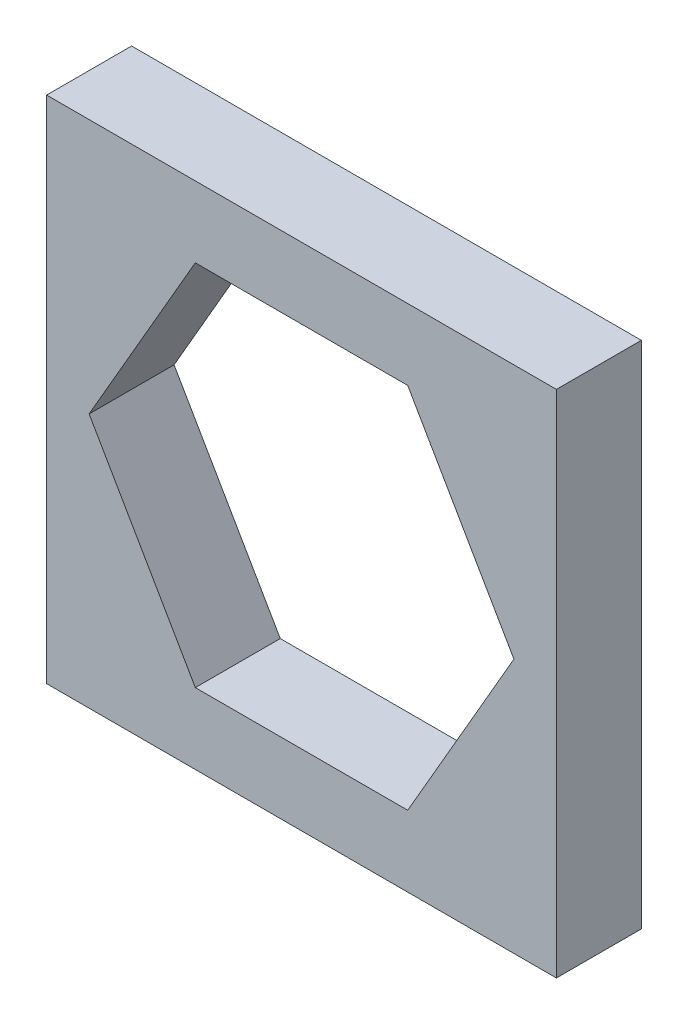
ISO-10303-21;
HEADER;
FILE_DESCRIPTION(('STEP AP214'),'2;1');
FILE_NAME('part.step','',(''),(''),'','','');
FILE_SCHEMA(('AUTOMOTIVE_DESIGN { 1 0 10303 214 1 1 1 1 }'));
ENDSEC;
DATA;
#1=APPLICATION_CONTEXT('core data for automotive mechanical design processes');
#2=APPLICATION_PROTOCOL_DEFINITION('international standard','automotive_design',2000,#1);
#3=PRODUCT_CONTEXT('',#1,'mechanical');
#4=PRODUCT('Part','Part','',(#3));
#5=PRODUCT_RELATED_PRODUCT_CATEGORY('part','',(#4));
#6=PRODUCT_DEFINITION_FORMATION('','',#4);
#7=PRODUCT_DEFINITION_CONTEXT('part definition',#1,'design');
#8=PRODUCT_DEFINITION('design','',#6,#7);
#9=PRODUCT_DEFINITION_SHAPE('','',#8);
#10=(LENGTH_UNIT() NAMED_UNIT(*) SI_UNIT(.MILLI.,.METRE.));
#11=(NAMED_UNIT(*) PLANE_ANGLE_UNIT() SI_UNIT($,.RADIAN.));
#12=(NAMED_UNIT(*) SI_UNIT($,.STERADIAN.) SOLID_ANGLE_UNIT());
#13=UNCERTAINTY_MEASURE_WITH_UNIT(LENGTH_MEASURE(1.E-05),#10,'distance_accuracy_value','');
#14=(GEOMETRIC_REPRESENTATION_CONTEXT(3) GLOBAL_UNCERTAINTY_ASSIGNED_CONTEXT((#13)) GLOBAL_UNIT_ASSIGNED_CONTEXT((#10,
#11,#12)) REPRESENTATION_CONTEXT('',''));
#15=CARTESIAN_POINT('',(0.,0.,0.));
#16=DIRECTION('',(0.,0.,1.));
#17=DIRECTION('',(1.,0.,0.));
#18=AXIS2_PLACEMENT_3D('',#15,#16,#17);
#19=CARTESIAN_POINT('',(0.,0.,10.));
#20=DIRECTION('',(0.,0.,1.));
#21=DIRECTION('',(1.,0.,0.));
#22=AXIS2_PLACEMENT_3D('',#19,#20,#21);
#23=PLANE('',#22);
#24=DIRECTION('',(0.,-1.,0.));
#25=VECTOR('',#24,1.);
#26=CARTESIAN_POINT('',(-30.,30.,10.));
#27=LINE('',#26,#25);
#28=CARTESIAN_POINT('',(-30.,30.,10.));
#29=VERTEX_POINT('',#28);
#30=CARTESIAN_POINT('',(-30.,-30.,10.));
#31=VERTEX_POINT('',#30);
#32=EDGE_CURVE('E191',#29,#31,#27,.T.);
#33=ORIENTED_EDGE('',*,*,#32,.T.);
#34=DIRECTION('',(1.,0.,0.));
#35=VECTOR('',#34,1.);
#36=CARTESIAN_POINT('',(-30.,-30.,10.));
#37=LINE('',#36,#35);
#38=CARTESIAN_POINT('',(30.,-30.,10.));
#39=VERTEX_POINT('',#38);
#40=EDGE_CURVE('E194',#31,#39,#37,.T.);
#41=ORIENTED_EDGE('',*,*,#40,.T.);
#42=DIRECTION('',(0.,-1.,0.));
#43=VECTOR('',#42,1.);
#44=CARTESIAN_POINT('',(30.,30.,10.));
#45=LINE('',#44,#43);
#46=CARTESIAN_POINT('',(30.,30.,10.));
#47=VERTEX_POINT('',#46);
#48=EDGE_CURVE('E197',#47,#39,#45,.T.);
#49=ORIENTED_EDGE('',*,*,#48,.F.);
#50=DIRECTION('',(1.,0.,0.));
#51=VECTOR('',#50,1.);
#52=CARTESIAN_POINT('',(-30.,30.,10.));
#53=LINE('',#52,#51);
#54=EDGE_CURVE('E200',#29,#47,#53,.T.);
#55=ORIENTED_EDGE('',*,*,#54,.F.);
#56=EDGE_LOOP('',(#33,#41,#49,#55));
#57=FACE_BOUND('',#56,.T.);
#58=DIRECTION('',(-0.5,0.866025403784439,0.));
#59=VECTOR('',#58,1.);
#60=CARTESIAN_POINT('',(25.,0.,10.));
#61=LINE('',#60,#59);
#62=CARTESIAN_POINT('',(25.,0.,10.));
#63=VERTEX_POINT('',#62);
#64=CARTESIAN_POINT('',(12.5,21.650635094611,10.));
#65=VERTEX_POINT('',#64);
#66=EDGE_CURVE('E148',#63,#65,#61,.T.);
#67=ORIENTED_EDGE('',*,*,#66,.F.);
#68=DIRECTION('',(0.5,0.866025403784439,0.));
#69=VECTOR('',#68,1.);
#70=CARTESIAN_POINT('',(12.5,-21.650635094611,10.));
#71=LINE('',#70,#69);
#72=CARTESIAN_POINT('',(12.5,-21.650635094611,10.));
#73=VERTEX_POINT('',#72);
#74=EDGE_CURVE('E140',#73,#63,#71,.T.);
#75=ORIENTED_EDGE('',*,*,#74,.F.);
#76=DIRECTION('',(1.,0.,0.));
#77=VECTOR('',#76,1.);
#78=CARTESIAN_POINT('',(-12.5,-21.650635094611,10.));
#79=LINE('',#78,#77);
#80=CARTESIAN_POINT('',(-12.5,-21.650635094611,10.));
#81=VERTEX_POINT('',#80);
#82=EDGE_CURVE('E169',#81,#73,#79,.T.);
#83=ORIENTED_EDGE('',*,*,#82,.F.);
#84=DIRECTION('',(0.5,-0.866025403784439,0.));
#85=VECTOR('',#84,1.);
#86=CARTESIAN_POINT('',(-25.,0.,10.));
#87=LINE('',#86,#85);
#88=CARTESIAN_POINT('',(-25.,0.,10.));
#89=VERTEX_POINT('',#88);
#90=EDGE_CURVE('E167',#89,#81,#87,.T.);
#91=ORIENTED_EDGE('',*,*,#90,.F.);
#92=DIRECTION('',(-0.5,-0.866025403784439,0.));
#93=VECTOR('',#92,1.);
#94=CARTESIAN_POINT('',(-12.5,21.650635094611,10.));
#95=LINE('',#94,#93);
#96=CARTESIAN_POINT('',(-12.5,21.650635094611,10.));
#97=VERTEX_POINT('',#96);
#98=EDGE_CURVE('E163',#97,#89,#95,.T.);
#99=ORIENTED_EDGE('',*,*,#98,.F.);
#100=DIRECTION('',(-1.,0.,0.));
#101=VECTOR('',#100,1.);
#102=CARTESIAN_POINT('',(12.5,21.650635094611,10.));
#103=LINE('',#102,#101);
#104=EDGE_CURVE('E161',#65,#97,#103,.T.);
#105=ORIENTED_EDGE('',*,*,#104,.F.);
#106=EDGE_LOOP('',(#67,#75,#83,#91,#99,#105));
#107=FACE_BOUND('',#106,.T.);
#108=ADVANCED_FACE('F63',(#57,#107),#23,.T.);
#109=CARTESIAN_POINT('',(0.,0.,0.));
#110=DIRECTION('',(0.,0.,1.));
#111=DIRECTION('',(1.,0.,0.));
#112=AXIS2_PLACEMENT_3D('',#109,#110,#111);
#113=PLANE('',#112);
#114=DIRECTION('',(0.,-1.,0.));
#115=VECTOR('',#114,1.);
#116=CARTESIAN_POINT('',(-30.,30.,0.));
#117=LINE('',#116,#115);
#118=CARTESIAN_POINT('',(-30.,30.,0.));
#119=VERTEX_POINT('',#118);
#120=CARTESIAN_POINT('',(-30.,-30.,0.));
#121=VERTEX_POINT('',#120);
#122=EDGE_CURVE('E156',#119,#121,#117,.T.);
#123=ORIENTED_EDGE('',*,*,#122,.F.);
#124=DIRECTION('',(1.,0.,0.));
#125=VECTOR('',#124,1.);
#126=CARTESIAN_POINT('',(-30.,30.,0.));
#127=LINE('',#126,#125);
#128=CARTESIAN_POINT('',(30.,30.,0.));
#129=VERTEX_POINT('',#128);
#130=EDGE_CURVE('E195',#119,#129,#127,.T.);
#131=ORIENTED_EDGE('',*,*,#130,.T.);
#132=DIRECTION('',(0.,-1.,0.));
#133=VECTOR('',#132,1.);
#134=CARTESIAN_POINT('',(30.,30.,0.));
#135=LINE('',#134,#133);
#136=CARTESIAN_POINT('',(30.,-30.,0.));
#137=VERTEX_POINT('',#136);
#138=EDGE_CURVE('E209',#129,#137,#135,.T.);
#139=ORIENTED_EDGE('',*,*,#138,.T.);
#140=DIRECTION('',(1.,0.,0.));
#141=VECTOR('',#140,1.);
#142=CARTESIAN_POINT('',(-30.,-30.,0.));
#143=LINE('',#142,#141);
#144=EDGE_CURVE('E206',#121,#137,#143,.T.);
#145=ORIENTED_EDGE('',*,*,#144,.F.);
#146=EDGE_LOOP('',(#123,#131,#139,#145));
#147=FACE_BOUND('',#146,.T.);
#148=DIRECTION('',(0.5,0.866025403784439,0.));
#149=VECTOR('',#148,1.);
#150=CARTESIAN_POINT('',(12.5,-21.650635094611,0.));
#151=LINE('',#150,#149);
#152=CARTESIAN_POINT('',(12.5,-21.650635094611,0.));
#153=VERTEX_POINT('',#152);
#154=CARTESIAN_POINT('',(25.,0.,0.));
#155=VERTEX_POINT('',#154);
#156=EDGE_CURVE('E86',#153,#155,#151,.T.);
#157=ORIENTED_EDGE('',*,*,#156,.T.);
#158=DIRECTION('',(-0.5,0.866025403784439,0.));
#159=VECTOR('',#158,1.);
#160=CARTESIAN_POINT('',(25.,0.,0.));
#161=LINE('',#160,#159);
#162=CARTESIAN_POINT('',(12.5,21.650635094611,0.));
#163=VERTEX_POINT('',#162);
#164=EDGE_CURVE('E155',#155,#163,#161,.T.);
#165=ORIENTED_EDGE('',*,*,#164,.T.);
#166=DIRECTION('',(-1.,0.,0.));
#167=VECTOR('',#166,1.);
#168=CARTESIAN_POINT('',(12.5,21.650635094611,0.));
#169=LINE('',#168,#167);
#170=CARTESIAN_POINT('',(-12.5,21.650635094611,0.));
#171=VERTEX_POINT('',#170);
#172=EDGE_CURVE('E173',#163,#171,#169,.T.);
#173=ORIENTED_EDGE('',*,*,#172,.T.);
#174=DIRECTION('',(-0.5,-0.866025403784439,0.));
#175=VECTOR('',#174,1.);
#176=CARTESIAN_POINT('',(-12.5,21.650635094611,0.));
#177=LINE('',#176,#175);
#178=CARTESIAN_POINT('',(-25.,0.,0.));
#179=VERTEX_POINT('',#178);
#180=EDGE_CURVE('E176',#171,#179,#177,.T.);
#181=ORIENTED_EDGE('',*,*,#180,.T.);
#182=DIRECTION('',(0.5,-0.866025403784439,0.));
#183=VECTOR('',#182,1.);
#184=CARTESIAN_POINT('',(-25.,0.,0.));
#185=LINE('',#184,#183);
#186=CARTESIAN_POINT('',(-12.5,-21.650635094611,0.));
#187=VERTEX_POINT('',#186);
#188=EDGE_CURVE('E179',#179,#187,#185,.T.);
#189=ORIENTED_EDGE('',*,*,#188,.T.);
#190=DIRECTION('',(1.,0.,0.));
#191=VECTOR('',#190,1.);
#192=CARTESIAN_POINT('',(-12.5,-21.650635094611,0.));
#193=LINE('',#192,#191);
#194=EDGE_CURVE('E149',#187,#153,#193,.T.);
#195=ORIENTED_EDGE('',*,*,#194,.T.);
#196=EDGE_LOOP('',(#157,#165,#173,#181,#189,#195));
#197=FACE_BOUND('',#196,.T.);
#198=ADVANCED_FACE('F226',(#147,#197),#113,.F.);
#199=CARTESIAN_POINT('',(-30.,30.,10.));
#200=DIRECTION('',(1.,0.,0.));
#201=DIRECTION('',(0.,1.,0.));
#202=AXIS2_PLACEMENT_3D('',#199,#200,#201);
#203=PLANE('',#202);
#204=ORIENTED_EDGE('',*,*,#122,.T.);
#205=DIRECTION('',(0.,0.,-1.));
#206=VECTOR('',#205,1.);
#207=CARTESIAN_POINT('',(-30.,-30.,10.));
#208=LINE('',#207,#206);
#209=EDGE_CURVE('E12',#31,#121,#208,.T.);
#210=ORIENTED_EDGE('',*,*,#209,.F.);
#211=ORIENTED_EDGE('',*,*,#32,.F.);
#212=DIRECTION('',(0.,0.,-1.));
#213=VECTOR('',#212,1.);
#214=CARTESIAN_POINT('',(-30.,30.,10.));
#215=LINE('',#214,#213);
#216=EDGE_CURVE('E203',#29,#119,#215,.T.);
#217=ORIENTED_EDGE('',*,*,#216,.T.);
#218=EDGE_LOOP('',(#204,#210,#211,#217));
#219=FACE_BOUND('',#218,.T.);
#220=ADVANCED_FACE('F65',(#219),#203,.F.);
#221=CARTESIAN_POINT('',(-30.,-30.,10.));
#222=DIRECTION('',(0.,1.,0.));
#223=DIRECTION('',(0.,0.,1.));
#224=AXIS2_PLACEMENT_3D('',#221,#222,#223);
#225=PLANE('',#224);
#226=ORIENTED_EDGE('',*,*,#144,.T.);
#227=DIRECTION('',(0.,0.,-1.));
#228=VECTOR('',#227,1.);
#229=CARTESIAN_POINT('',(30.,-30.,10.));
#230=LINE('',#229,#228);
#231=EDGE_CURVE('E71',#39,#137,#230,.T.);
#232=ORIENTED_EDGE('',*,*,#231,.F.);
#233=ORIENTED_EDGE('',*,*,#40,.F.);
#234=ORIENTED_EDGE('',*,*,#209,.T.);
#235=EDGE_LOOP('',(#226,#232,#233,#234));
#236=FACE_BOUND('',#235,.T.);
#237=ADVANCED_FACE('F222',(#236),#225,.F.);
#238=CARTESIAN_POINT('',(30.,30.,10.));
#239=DIRECTION('',(1.,0.,0.));
#240=DIRECTION('',(0.,0.,-1.));
#241=AXIS2_PLACEMENT_3D('',#238,#239,#240);
#242=PLANE('',#241);
#243=ORIENTED_EDGE('',*,*,#138,.F.);
#244=DIRECTION('',(0.,0.,-1.));
#245=VECTOR('',#244,1.);
#246=CARTESIAN_POINT('',(30.,30.,10.));
#247=LINE('',#246,#245);
#248=EDGE_CURVE('E215',#47,#129,#247,.T.);
#249=ORIENTED_EDGE('',*,*,#248,.F.);
#250=ORIENTED_EDGE('',*,*,#48,.T.);
#251=ORIENTED_EDGE('',*,*,#231,.T.);
#252=EDGE_LOOP('',(#243,#249,#250,#251));
#253=FACE_BOUND('',#252,.T.);
#254=ADVANCED_FACE('F219',(#253),#242,.T.);
#255=CARTESIAN_POINT('',(-30.,30.,10.));
#256=DIRECTION('',(0.,1.,0.));
#257=DIRECTION('',(0.,0.,1.));
#258=AXIS2_PLACEMENT_3D('',#255,#256,#257);
#259=PLANE('',#258);
#260=ORIENTED_EDGE('',*,*,#130,.F.);
#261=ORIENTED_EDGE('',*,*,#216,.F.);
#262=ORIENTED_EDGE('',*,*,#54,.T.);
#263=ORIENTED_EDGE('',*,*,#248,.T.);
#264=EDGE_LOOP('',(#260,#261,#262,#263));
#265=FACE_BOUND('',#264,.T.);
#266=ADVANCED_FACE('F230',(#265),#259,.T.);
#267=CARTESIAN_POINT('',(12.5,-21.650635094611,10.));
#268=DIRECTION('',(-0.866025403784439,0.5,0.));
#269=DIRECTION('',(-0.5,-0.866025403784439,0.));
#270=AXIS2_PLACEMENT_3D('',#267,#268,#269);
#271=PLANE('',#270);
#272=ORIENTED_EDGE('',*,*,#156,.F.);
#273=DIRECTION('',(0.,0.,-1.));
#274=VECTOR('',#273,1.);
#275=CARTESIAN_POINT('',(12.5,-21.650635094611,10.));
#276=LINE('',#275,#274);
#277=EDGE_CURVE('E144',#73,#153,#276,.T.);
#278=ORIENTED_EDGE('',*,*,#277,.F.);
#279=ORIENTED_EDGE('',*,*,#74,.T.);
#280=DIRECTION('',(0.,0.,-1.));
#281=VECTOR('',#280,1.);
#282=CARTESIAN_POINT('',(25.,0.,10.));
#283=LINE('',#282,#281);
#284=EDGE_CURVE('E143',#63,#155,#283,.T.);
#285=ORIENTED_EDGE('',*,*,#284,.T.);
#286=EDGE_LOOP('',(#272,#278,#279,#285));
#287=FACE_BOUND('',#286,.T.);
#288=ADVANCED_FACE('F142',(#287),#271,.T.);
#289=CARTESIAN_POINT('',(25.,0.,10.));
#290=DIRECTION('',(-0.866025403784439,-0.5,0.));
#291=DIRECTION('',(0.5,-0.866025403784439,0.));
#292=AXIS2_PLACEMENT_3D('',#289,#290,#291);
#293=PLANE('',#292);
#294=ORIENTED_EDGE('',*,*,#164,.F.);
#295=ORIENTED_EDGE('',*,*,#284,.F.);
#296=ORIENTED_EDGE('',*,*,#66,.T.);
#297=DIRECTION('',(0.,0.,-1.));
#298=VECTOR('',#297,1.);
#299=CARTESIAN_POINT('',(12.5,21.650635094611,10.));
#300=LINE('',#299,#298);
#301=EDGE_CURVE('E157',#65,#163,#300,.T.);
#302=ORIENTED_EDGE('',*,*,#301,.T.);
#303=EDGE_LOOP('',(#294,#295,#296,#302));
#304=FACE_BOUND('',#303,.T.);
#305=ADVANCED_FACE('F152',(#304),#293,.T.);
#306=CARTESIAN_POINT('',(12.5,21.650635094611,10.));
#307=DIRECTION('',(0.,-1.,0.));
#308=DIRECTION('',(1.,0.,0.));
#309=AXIS2_PLACEMENT_3D('',#306,#307,#308);
#310=PLANE('',#309);
#311=ORIENTED_EDGE('',*,*,#172,.F.);
#312=ORIENTED_EDGE('',*,*,#301,.F.);
#313=ORIENTED_EDGE('',*,*,#104,.T.);
#314=DIRECTION('',(0.,0.,-1.));
#315=VECTOR('',#314,1.);
#316=CARTESIAN_POINT('',(-12.5,21.650635094611,10.));
#317=LINE('',#316,#315);
#318=EDGE_CURVE('E188',#97,#171,#317,.T.);
#319=ORIENTED_EDGE('',*,*,#318,.T.);
#320=EDGE_LOOP('',(#311,#312,#313,#319));
#321=FACE_BOUND('',#320,.T.);
#322=ADVANCED_FACE('F270',(#321),#310,.T.);
#323=CARTESIAN_POINT('',(-12.5,21.650635094611,10.));
#324=DIRECTION('',(0.866025403784439,-0.5,0.));
#325=DIRECTION('',(0.5,0.866025403784439,0.));
#326=AXIS2_PLACEMENT_3D('',#323,#324,#325);
#327=PLANE('',#326);
#328=ORIENTED_EDGE('',*,*,#180,.F.);
#329=ORIENTED_EDGE('',*,*,#318,.F.);
#330=ORIENTED_EDGE('',*,*,#98,.T.);
#331=DIRECTION('',(0.,0.,-1.));
#332=VECTOR('',#331,1.);
#333=CARTESIAN_POINT('',(-25.,0.,10.));
#334=LINE('',#333,#332);
#335=EDGE_CURVE('E186',#89,#179,#334,.T.);
#336=ORIENTED_EDGE('',*,*,#335,.T.);
#337=EDGE_LOOP('',(#328,#329,#330,#336));
#338=FACE_BOUND('',#337,.T.);
#339=ADVANCED_FACE('F276',(#338),#327,.T.);
#340=CARTESIAN_POINT('',(-25.,0.,10.));
#341=DIRECTION('',(0.866025403784439,0.5,0.));
#342=DIRECTION('',(-0.5,0.866025403784439,0.));
#343=AXIS2_PLACEMENT_3D('',#340,#341,#342);
#344=PLANE('',#343);
#345=ORIENTED_EDGE('',*,*,#188,.F.);
#346=ORIENTED_EDGE('',*,*,#335,.F.);
#347=ORIENTED_EDGE('',*,*,#90,.T.);
#348=DIRECTION('',(0.,0.,-1.));
#349=VECTOR('',#348,1.);
#350=CARTESIAN_POINT('',(-12.5,-21.650635094611,10.));
#351=LINE('',#350,#349);
#352=EDGE_CURVE('E78',#81,#187,#351,.T.);
#353=ORIENTED_EDGE('',*,*,#352,.T.);
#354=EDGE_LOOP('',(#345,#346,#347,#353));
#355=FACE_BOUND('',#354,.T.);
#356=ADVANCED_FACE('F284',(#355),#344,.T.);
#357=CARTESIAN_POINT('',(-12.5,-21.650635094611,10.));
#358=DIRECTION('',(0.,1.,0.));
#359=DIRECTION('',(-1.,0.,0.));
#360=AXIS2_PLACEMENT_3D('',#357,#358,#359);
#361=PLANE('',#360);
#362=ORIENTED_EDGE('',*,*,#194,.F.);
#363=ORIENTED_EDGE('',*,*,#352,.F.);
#364=ORIENTED_EDGE('',*,*,#82,.T.);
#365=ORIENTED_EDGE('',*,*,#277,.T.);
#366=EDGE_LOOP('',(#362,#363,#364,#365));
#367=FACE_BOUND('',#366,.T.);
#368=ADVANCED_FACE('F292',(#367),#361,.T.);
#369=CLOSED_SHELL('',(#108,#198,#220,#237,#254,#266,#288,#305,#322,#339,#356,#368));
#370=MANIFOLD_SOLID_BREP('B2',#369);
#371=ADVANCED_BREP_SHAPE_REPRESENTATION('',(#18,#370),#14);
#372=SHAPE_DEFINITION_REPRESENTATION(#9,#371);
ENDSEC;
END-ISO-10303-21;
